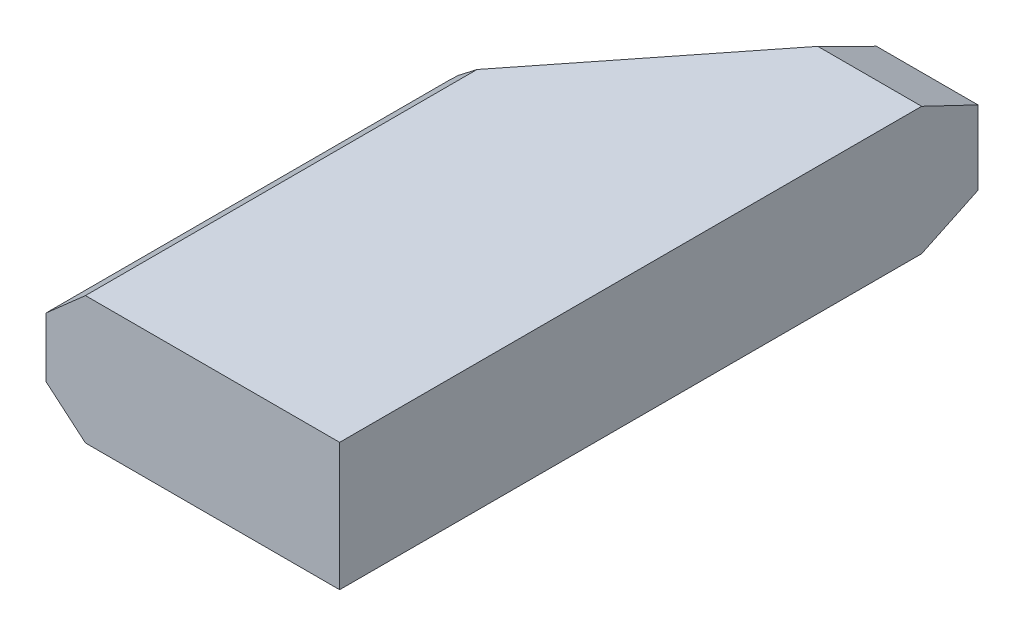
ISO-10303-21;
HEADER;
FILE_DESCRIPTION(('STEP AP214'),'2;1');
FILE_NAME('part.step','',(''),(''),'','','');
FILE_SCHEMA(('AUTOMOTIVE_DESIGN { 1 0 10303 214 1 1 1 1 }'));
ENDSEC;
DATA;
#1=APPLICATION_CONTEXT('core data for automotive mechanical design processes');
#2=APPLICATION_PROTOCOL_DEFINITION('international standard','automotive_design',2000,#1);
#3=PRODUCT_CONTEXT('',#1,'mechanical');
#4=PRODUCT('Part','Part','',(#3));
#5=PRODUCT_RELATED_PRODUCT_CATEGORY('part','',(#4));
#6=PRODUCT_DEFINITION_FORMATION('','',#4);
#7=PRODUCT_DEFINITION_CONTEXT('part definition',#1,'design');
#8=PRODUCT_DEFINITION('design','',#6,#7);
#9=PRODUCT_DEFINITION_SHAPE('','',#8);
#10=(LENGTH_UNIT() NAMED_UNIT(*) SI_UNIT(.MILLI.,.METRE.));
#11=(NAMED_UNIT(*) PLANE_ANGLE_UNIT() SI_UNIT($,.RADIAN.));
#12=(NAMED_UNIT(*) SI_UNIT($,.STERADIAN.) SOLID_ANGLE_UNIT());
#13=UNCERTAINTY_MEASURE_WITH_UNIT(LENGTH_MEASURE(1.E-05),#10,'distance_accuracy_value','');
#14=(GEOMETRIC_REPRESENTATION_CONTEXT(3) GLOBAL_UNCERTAINTY_ASSIGNED_CONTEXT((#13)) GLOBAL_UNIT_ASSIGNED_CONTEXT((#10,
#11,#12)) REPRESENTATION_CONTEXT('',''));
#15=CARTESIAN_POINT('',(0.,0.,0.));
#16=DIRECTION('',(0.,0.,1.));
#17=DIRECTION('',(1.,0.,0.));
#18=AXIS2_PLACEMENT_3D('',#15,#16,#17);
#19=CARTESIAN_POINT('',(0.,0.,-508.));
#20=DIRECTION('',(1.,0.,0.));
#21=DIRECTION('',(0.,0.,-1.));
#22=AXIS2_PLACEMENT_3D('',#19,#20,#21);
#23=PLANE('',#22);
#24=DIRECTION('',(0.,-0.429413418886791,0.903108031012878));
#25=VECTOR('',#24,1.);
#26=CARTESIAN_POINT('',(0.,0.,-463.161638797498));
#27=LINE('',#26,#25);
#28=CARTESIAN_POINT('',(0.,21.3199233314895,-508.));
#29=VERTEX_POINT('',#28);
#30=CARTESIAN_POINT('',(0.,0.,-463.161638797498));
#31=VERTEX_POINT('',#30);
#32=EDGE_CURVE('E169',#29,#31,#27,.T.);
#33=ORIENTED_EDGE('',*,*,#32,.F.);
#34=DIRECTION('',(0.,1.,0.));
#35=VECTOR('',#34,1.);
#36=CARTESIAN_POINT('',(0.,0.,-508.));
#37=LINE('',#36,#35);
#38=CARTESIAN_POINT('',(0.,80.1575164459482,-508.));
#39=VERTEX_POINT('',#38);
#40=EDGE_CURVE('E155',#29,#39,#37,.T.);
#41=ORIENTED_EDGE('',*,*,#40,.T.);
#42=DIRECTION('',(0.,-0.431423565478039,-0.902149492684121));
#43=VECTOR('',#42,1.);
#44=CARTESIAN_POINT('',(0.,101.6,-463.161638797498));
#45=LINE('',#44,#43);
#46=CARTESIAN_POINT('',(0.,101.6,-463.161638797498));
#47=VERTEX_POINT('',#46);
#48=EDGE_CURVE('E175',#47,#39,#45,.T.);
#49=ORIENTED_EDGE('',*,*,#48,.F.);
#50=DIRECTION('',(0.,0.,1.));
#51=VECTOR('',#50,1.);
#52=CARTESIAN_POINT('',(0.,101.6,-508.));
#53=LINE('',#52,#51);
#54=CARTESIAN_POINT('',(0.,101.6,0.));
#55=VERTEX_POINT('',#54);
#56=EDGE_CURVE('E152',#47,#55,#53,.T.);
#57=ORIENTED_EDGE('',*,*,#56,.T.);
#58=DIRECTION('',(0.,1.,0.));
#59=VECTOR('',#58,1.);
#60=CARTESIAN_POINT('',(0.,0.,0.));
#61=LINE('',#60,#59);
#62=CARTESIAN_POINT('',(0.,0.,0.));
#63=VERTEX_POINT('',#62);
#64=EDGE_CURVE('E139',#63,#55,#61,.T.);
#65=ORIENTED_EDGE('',*,*,#64,.F.);
#66=DIRECTION('',(0.,0.,1.));
#67=VECTOR('',#66,1.);
#68=CARTESIAN_POINT('',(0.,0.,-508.));
#69=LINE('',#68,#67);
#70=EDGE_CURVE('E138',#31,#63,#69,.T.);
#71=ORIENTED_EDGE('',*,*,#70,.F.);
#72=EDGE_LOOP('',(#33,#41,#49,#57,#65,#71));
#73=FACE_BOUND('',#72,.T.);
#74=ADVANCED_FACE('F32',(#73),#23,.T.);
#75=CARTESIAN_POINT('',(0.,0.,-508.));
#76=DIRECTION('',(0.,-1.,0.));
#77=DIRECTION('',(0.,0.,-1.));
#78=AXIS2_PLACEMENT_3D('',#75,#76,#77);
#79=PLANE('',#78);
#80=DIRECTION('',(0.619644288579021,0.,-0.784882765533426));
#81=VECTOR('',#80,1.);
#82=CARTESIAN_POINT('',(-365.894548514478,-1.07506525137836E-12,-104.379906721956));
#83=LINE('',#82,#81);
#84=CARTESIAN_POINT('',(-202.283526952623,-4.47404655459673E-13,-311.62053403364));
#85=VERTEX_POINT('',#84);
#86=CARTESIAN_POINT('',(-82.6458126653662,0.,-463.161638797498));
#87=VERTEX_POINT('',#86);
#88=EDGE_CURVE('E154',#85,#87,#83,.T.);
#89=ORIENTED_EDGE('',*,*,#88,.T.);
#90=DIRECTION('',(1.,0.,0.));
#91=VECTOR('',#90,1.);
#92=CARTESIAN_POINT('',(-233.68,0.,-463.161638797498));
#93=LINE('',#92,#91);
#94=EDGE_CURVE('E151',#87,#31,#93,.T.);
#95=ORIENTED_EDGE('',*,*,#94,.T.);
#96=ORIENTED_EDGE('',*,*,#70,.T.);
#97=DIRECTION('',(1.,0.,0.));
#98=VECTOR('',#97,1.);
#99=CARTESIAN_POINT('',(0.,0.,0.));
#100=LINE('',#99,#98);
#101=CARTESIAN_POINT('',(-202.283526952623,0.,0.));
#102=VERTEX_POINT('',#101);
#103=EDGE_CURVE('E129',#102,#63,#100,.T.);
#104=ORIENTED_EDGE('',*,*,#103,.F.);
#105=DIRECTION('',(0.,0.,1.));
#106=VECTOR('',#105,1.);
#107=CARTESIAN_POINT('',(-202.283526952623,0.,-508.));
#108=LINE('',#107,#106);
#109=EDGE_CURVE('E116',#85,#102,#108,.T.);
#110=ORIENTED_EDGE('',*,*,#109,.F.);
#111=EDGE_LOOP('',(#89,#95,#96,#104,#110));
#112=FACE_BOUND('',#111,.T.);
#113=ADVANCED_FACE('F136',(#112),#79,.T.);
#114=CARTESIAN_POINT('',(-233.68,0.,-508.));
#115=DIRECTION('',(-1.,0.,0.));
#116=DIRECTION('',(0.,0.,1.));
#117=AXIS2_PLACEMENT_3D('',#114,#115,#116);
#118=PLANE('',#117);
#119=DIRECTION('',(0.,0.480454682315268,-0.877019554081512));
#120=VECTOR('',#119,1.);
#121=CARTESIAN_POINT('',(-233.68,99.5053860002083,-453.48829795539));
#122=LINE('',#121,#120);
#123=CARTESIAN_POINT('',(-233.68,26.611014762092,-320.427280316363));
#124=VERTEX_POINT('',#123);
#125=CARTESIAN_POINT('',(-233.68,27.2456457358276,-321.585732495265));
#126=VERTEX_POINT('',#125);
#127=EDGE_CURVE('E11',#124,#126,#122,.T.);
#128=ORIENTED_EDGE('',*,*,#127,.F.);
#129=DIRECTION('',(0.,0.,1.));
#130=VECTOR('',#129,1.);
#131=CARTESIAN_POINT('',(-233.68,26.6110147620919,-508.));
#132=LINE('',#131,#130);
#133=CARTESIAN_POINT('',(-233.68,26.6110147620919,0.));
#134=VERTEX_POINT('',#133);
#135=EDGE_CURVE('E150',#124,#134,#132,.T.);
#136=ORIENTED_EDGE('',*,*,#135,.T.);
#137=DIRECTION('',(0.,-1.,0.));
#138=VECTOR('',#137,1.);
#139=CARTESIAN_POINT('',(-233.68,0.,0.));
#140=LINE('',#139,#138);
#141=CARTESIAN_POINT('',(-233.68,73.9080678482201,0.));
#142=VERTEX_POINT('',#141);
#143=EDGE_CURVE('E133',#142,#134,#140,.T.);
#144=ORIENTED_EDGE('',*,*,#143,.F.);
#145=DIRECTION('',(0.,0.,1.));
#146=VECTOR('',#145,1.);
#147=CARTESIAN_POINT('',(-233.68,73.9080678482201,-508.));
#148=LINE('',#147,#146);
#149=CARTESIAN_POINT('',(-233.68,73.9080678482201,-321.585732495265));
#150=VERTEX_POINT('',#149);
#151=EDGE_CURVE('E195',#150,#142,#148,.T.);
#152=ORIENTED_EDGE('',*,*,#151,.F.);
#153=DIRECTION('',(0.,1.,0.));
#154=VECTOR('',#153,1.);
#155=CARTESIAN_POINT('',(-233.68,0.,-321.585732495265));
#156=LINE('',#155,#154);
#157=EDGE_CURVE('E165',#126,#150,#156,.T.);
#158=ORIENTED_EDGE('',*,*,#157,.F.);
#159=EDGE_LOOP('',(#128,#136,#144,#152,#158));
#160=FACE_BOUND('',#159,.T.);
#161=ADVANCED_FACE('F217',(#160),#118,.T.);
#162=CARTESIAN_POINT('',(0.,101.6,-508.));
#163=DIRECTION('',(0.,1.,0.));
#164=DIRECTION('',(0.,0.,1.));
#165=AXIS2_PLACEMENT_3D('',#162,#163,#164);
#166=PLANE('',#165);
#167=DIRECTION('',(0.619644288579021,0.,-0.784882765533426));
#168=VECTOR('',#167,1.);
#169=CARTESIAN_POINT('',(-365.894548514478,101.599999999999,-104.379906721956));
#170=LINE('',#169,#168);
#171=CARTESIAN_POINT('',(-202.283526952624,101.6,-311.620534033638));
#172=VERTEX_POINT('',#171);
#173=CARTESIAN_POINT('',(-82.6458126653659,101.6,-463.161638797498));
#174=VERTEX_POINT('',#173);
#175=EDGE_CURVE('E42',#172,#174,#170,.T.);
#176=ORIENTED_EDGE('',*,*,#175,.F.);
#177=DIRECTION('',(0.,0.,1.));
#178=VECTOR('',#177,1.);
#179=CARTESIAN_POINT('',(-202.283526952623,101.6,-508.));
#180=LINE('',#179,#178);
#181=CARTESIAN_POINT('',(-202.283526952623,101.6,0.));
#182=VERTEX_POINT('',#181);
#183=EDGE_CURVE('E167',#172,#182,#180,.T.);
#184=ORIENTED_EDGE('',*,*,#183,.T.);
#185=DIRECTION('',(-1.,0.,0.));
#186=VECTOR('',#185,1.);
#187=CARTESIAN_POINT('',(0.,101.6,0.));
#188=LINE('',#187,#186);
#189=EDGE_CURVE('E142',#55,#182,#188,.T.);
#190=ORIENTED_EDGE('',*,*,#189,.F.);
#191=ORIENTED_EDGE('',*,*,#56,.F.);
#192=DIRECTION('',(1.,0.,0.));
#193=VECTOR('',#192,1.);
#194=CARTESIAN_POINT('',(-233.68,101.6,-463.161638797498));
#195=LINE('',#194,#193);
#196=EDGE_CURVE('E159',#174,#47,#195,.T.);
#197=ORIENTED_EDGE('',*,*,#196,.F.);
#198=EDGE_LOOP('',(#176,#184,#190,#191,#197));
#199=FACE_BOUND('',#198,.T.);
#200=ADVANCED_FACE('F208',(#199),#166,.T.);
#201=CARTESIAN_POINT('',(0.,0.,-508.));
#202=DIRECTION('',(0.,0.,1.));
#203=DIRECTION('',(1.,0.,0.));
#204=AXIS2_PLACEMENT_3D('',#201,#202,#203);
#205=PLANE('',#204);
#206=DIRECTION('',(1.,0.,0.));
#207=VECTOR('',#206,1.);
#208=CARTESIAN_POINT('',(-233.68,21.3199233314895,-508.));
#209=LINE('',#208,#207);
#210=CARTESIAN_POINT('',(-77.9712752917137,21.3199233314895,-508.));
#211=VERTEX_POINT('',#210);
#212=EDGE_CURVE('E168',#211,#29,#209,.T.);
#213=ORIENTED_EDGE('',*,*,#212,.F.);
#214=DIRECTION('',(-0.821574182423312,0.570101624954241,0.));
#215=VECTOR('',#214,1.);
#216=CARTESIAN_POINT('',(-15.3560590674221,-22.1296364039903,-508.));
#217=LINE('',#216,#215);
#218=CARTESIAN_POINT('',(-87.0707706911871,27.6341883353326,-507.999999988076));
#219=VERTEX_POINT('',#218);
#220=EDGE_CURVE('E69',#211,#219,#217,.T.);
#221=ORIENTED_EDGE('',*,*,#220,.T.);
#222=DIRECTION('',(0.,1.,0.));
#223=VECTOR('',#222,1.);
#224=CARTESIAN_POINT('',(-87.070770681791,0.,-508.));
#225=LINE('',#224,#223);
#226=CARTESIAN_POINT('',(-87.0707706840187,76.175565290538,-507.999999997173));
#227=VERTEX_POINT('',#226);
#228=EDGE_CURVE('E36',#219,#227,#225,.T.);
#229=ORIENTED_EDGE('',*,*,#228,.T.);
#230=DIRECTION('',(0.842873496109832,0.538111763071194,0.));
#231=VECTOR('',#230,1.);
#232=CARTESIAN_POINT('',(-59.7627844012635,93.6096745740283,-508.));
#233=LINE('',#232,#231);
#234=CARTESIAN_POINT('',(-80.833625683239,80.1575164459482,-508.));
#235=VERTEX_POINT('',#234);
#236=EDGE_CURVE('E144',#227,#235,#233,.T.);
#237=ORIENTED_EDGE('',*,*,#236,.T.);
#238=DIRECTION('',(1.,0.,0.));
#239=VECTOR('',#238,1.);
#240=CARTESIAN_POINT('',(-233.68,80.1575164459482,-508.));
#241=LINE('',#240,#239);
#242=EDGE_CURVE('E140',#235,#39,#241,.T.);
#243=ORIENTED_EDGE('',*,*,#242,.T.);
#244=ORIENTED_EDGE('',*,*,#40,.F.);
#245=EDGE_LOOP('',(#213,#221,#229,#237,#243,#244));
#246=FACE_BOUND('',#245,.T.);
#247=ADVANCED_FACE('F34',(#246),#205,.F.);
#248=CARTESIAN_POINT('',(0.,0.,0.));
#249=DIRECTION('',(0.,0.,1.));
#250=DIRECTION('',(1.,0.,0.));
#251=AXIS2_PLACEMENT_3D('',#248,#249,#250);
#252=PLANE('',#251);
#253=DIRECTION('',(-0.76284964895681,0.646575914403306,0.));
#254=VECTOR('',#253,1.);
#255=CARTESIAN_POINT('',(-202.283526952623,0.,0.));
#256=LINE('',#255,#254);
#257=EDGE_CURVE('E120',#102,#134,#256,.T.);
#258=ORIENTED_EDGE('',*,*,#257,.F.);
#259=ORIENTED_EDGE('',*,*,#103,.T.);
#260=ORIENTED_EDGE('',*,*,#64,.T.);
#261=ORIENTED_EDGE('',*,*,#189,.T.);
#262=DIRECTION('',(0.749966279509935,0.661476061243357,0.));
#263=VECTOR('',#262,1.);
#264=CARTESIAN_POINT('',(-202.283526952623,101.6,0.));
#265=LINE('',#264,#263);
#266=EDGE_CURVE('E161',#142,#182,#265,.T.);
#267=ORIENTED_EDGE('',*,*,#266,.F.);
#268=ORIENTED_EDGE('',*,*,#143,.T.);
#269=EDGE_LOOP('',(#258,#259,#260,#261,#267,#268));
#270=FACE_BOUND('',#269,.T.);
#271=ADVANCED_FACE('F127',(#270),#252,.T.);
#272=CARTESIAN_POINT('',(-202.283526952623,101.6,-508.));
#273=DIRECTION('',(0.661476061243357,-0.749966279509935,0.));
#274=DIRECTION('',(0.749966279509936,0.661476061243357,0.));
#275=AXIS2_PLACEMENT_3D('',#272,#273,#274);
#276=PLANE('',#275);
#277=ORIENTED_EDGE('',*,*,#183,.F.);
#278=DIRECTION('',(-0.705083175848917,-0.621888816540211,-0.340752131316916));
#279=VECTOR('',#278,1.);
#280=CARTESIAN_POINT('',(-249.465381518062,59.985239213025,-334.422549531031));
#281=LINE('',#280,#279);
#282=CARTESIAN_POINT('',(-230.712073852629,76.5258016739419,-325.359463394358));
#283=VERTEX_POINT('',#282);
#284=EDGE_CURVE('E187',#172,#283,#281,.T.);
#285=ORIENTED_EDGE('',*,*,#284,.T.);
#286=DIRECTION('',(-0.542752462982447,-0.478711871790235,0.690112097947556));
#287=VECTOR('',#286,1.);
#288=CARTESIAN_POINT('',(-147.412909387678,149.996309242821,-431.274710338239));
#289=LINE('',#288,#287);
#290=EDGE_CURVE('E189',#283,#150,#289,.T.);
#291=ORIENTED_EDGE('',*,*,#290,.T.);
#292=ORIENTED_EDGE('',*,*,#151,.T.);
#293=ORIENTED_EDGE('',*,*,#266,.T.);
#294=EDGE_LOOP('',(#277,#285,#291,#292,#293));
#295=FACE_BOUND('',#294,.T.);
#296=ADVANCED_FACE('F212',(#295),#276,.F.);
#297=CARTESIAN_POINT('',(-202.283526952623,0.,-508.));
#298=DIRECTION('',(0.646575914403306,0.76284964895681,0.));
#299=DIRECTION('',(-0.762849648956811,0.646575914403306,0.));
#300=AXIS2_PLACEMENT_3D('',#297,#298,#299);
#301=PLANE('',#300);
#302=ORIENTED_EDGE('',*,*,#135,.F.);
#303=DIRECTION('',(0.745962890005618,-0.632263039480828,0.209243436315052));
#304=VECTOR('',#303,1.);
#305=CARTESIAN_POINT('',(-232.935973314868,25.980392810653,-320.21857998771));
#306=LINE('',#305,#304);
#307=EDGE_CURVE('E50',#124,#85,#306,.T.);
#308=ORIENTED_EDGE('',*,*,#307,.T.);
#309=ORIENTED_EDGE('',*,*,#109,.T.);
#310=ORIENTED_EDGE('',*,*,#257,.T.);
#311=EDGE_LOOP('',(#302,#308,#309,#310));
#312=FACE_BOUND('',#311,.T.);
#313=ADVANCED_FACE('F119',(#312),#301,.F.);
#314=CARTESIAN_POINT('',(-87.070770681791,0.,-508.));
#315=DIRECTION('',(0.786029677767914,0.,0.618188762165788));
#316=DIRECTION('',(0.618188762165788,0.,-0.786029677767914));
#317=AXIS2_PLACEMENT_3D('',#314,#315,#316);
#318=PLANE('',#317);
#319=ORIENTED_EDGE('',*,*,#228,.F.);
#320=DIRECTION('',(-0.618187932530704,-0.00163831668315015,0.786028622883327));
#321=VECTOR('',#320,1.);
#322=CARTESIAN_POINT('',(-87.0987582451612,27.6341141629299,-507.964413692445));
#323=LINE('',#322,#321);
#324=EDGE_CURVE('E134',#219,#126,#323,.T.);
#325=ORIENTED_EDGE('',*,*,#324,.T.);
#326=ORIENTED_EDGE('',*,*,#157,.T.);
#327=ORIENTED_EDGE('',*,*,#290,.F.);
#328=DIRECTION('',(0.61818805990822,-0.00150730984464742,-0.786028784844387));
#329=VECTOR('',#328,1.);
#330=CARTESIAN_POINT('',(-86.9997902177974,76.1753922209484,-508.090251966155));
#331=LINE('',#330,#329);
#332=EDGE_CURVE('E160',#283,#227,#331,.T.);
#333=ORIENTED_EDGE('',*,*,#332,.T.);
#334=EDGE_LOOP('',(#319,#325,#326,#327,#333));
#335=FACE_BOUND('',#334,.T.);
#336=ADVANCED_FACE('F221',(#335),#318,.F.);
#337=CARTESIAN_POINT('',(-233.68,101.6,-463.161638797498));
#338=DIRECTION('',(0.,-0.90214949268412,0.431423565478039));
#339=DIRECTION('',(0.,-0.431423565478039,-0.902149492684121));
#340=AXIS2_PLACEMENT_3D('',#337,#338,#339);
#341=PLANE('',#340);
#342=ORIENTED_EDGE('',*,*,#242,.F.);
#343=DIRECTION('',(-0.0364370572768785,0.431137078636632,0.901550420265928));
#344=VECTOR('',#343,1.);
#345=CARTESIAN_POINT('',(-82.8463345850861,103.972651392066,-458.200189259394));
#346=LINE('',#345,#344);
#347=EDGE_CURVE('E156',#235,#174,#346,.T.);
#348=ORIENTED_EDGE('',*,*,#347,.T.);
#349=ORIENTED_EDGE('',*,*,#196,.T.);
#350=ORIENTED_EDGE('',*,*,#48,.T.);
#351=EDGE_LOOP('',(#342,#348,#349,#350));
#352=FACE_BOUND('',#351,.T.);
#353=ADVANCED_FACE('F228',(#352),#341,.F.);
#354=CARTESIAN_POINT('',(-233.68,0.,-463.161638797498));
#355=DIRECTION('',(0.,0.903108031012878,0.429413418886791));
#356=DIRECTION('',(0.,-0.429413418886791,0.903108031012878));
#357=AXIS2_PLACEMENT_3D('',#354,#355,#356);
#358=PLANE('',#357);
#359=ORIENTED_EDGE('',*,*,#94,.F.);
#360=DIRECTION('',(0.0937372430843206,0.427522699278668,-0.899131620431866));
#361=VECTOR('',#360,1.);
#362=CARTESIAN_POINT('',(-83.9729003401175,-6.05266472770893,-450.432157406831));
#363=LINE('',#362,#361);
#364=EDGE_CURVE('E64',#87,#211,#363,.T.);
#365=ORIENTED_EDGE('',*,*,#364,.T.);
#366=ORIENTED_EDGE('',*,*,#212,.T.);
#367=ORIENTED_EDGE('',*,*,#32,.T.);
#368=EDGE_LOOP('',(#359,#365,#366,#367));
#369=FACE_BOUND('',#368,.T.);
#370=ADVANCED_FACE('F232',(#369),#358,.F.);
#371=CARTESIAN_POINT('',(-365.894548514478,101.599999999999,-104.379906721956));
#372=DIRECTION('',(0.495272074440297,-0.775771379771588,0.391004269294969));
#373=DIRECTION('',(0.842873496109832,0.538111763071194,0.));
#374=AXIS2_PLACEMENT_3D('',#371,#372,#373);
#375=PLANE('',#374);
#376=ORIENTED_EDGE('',*,*,#175,.T.);
#377=ORIENTED_EDGE('',*,*,#347,.F.);
#378=ORIENTED_EDGE('',*,*,#236,.F.);
#379=ORIENTED_EDGE('',*,*,#332,.F.);
#380=ORIENTED_EDGE('',*,*,#284,.F.);
#381=EDGE_LOOP('',(#376,#377,#378,#379,#380));
#382=FACE_BOUND('',#381,.T.);
#383=ADVANCED_FACE('F226',(#382),#375,.F.);
#384=CARTESIAN_POINT('',(-390.42755668281,27.6341883353439,-123.748071065376));
#385=DIRECTION('',(0.519872322238841,0.749188669901032,0.410425517556982));
#386=DIRECTION('',(-0.821574182423312,0.570101624954241,0.));
#387=AXIS2_PLACEMENT_3D('',#384,#385,#386);
#388=PLANE('',#387);
#389=ORIENTED_EDGE('',*,*,#127,.T.);
#390=ORIENTED_EDGE('',*,*,#324,.F.);
#391=ORIENTED_EDGE('',*,*,#220,.F.);
#392=ORIENTED_EDGE('',*,*,#364,.F.);
#393=ORIENTED_EDGE('',*,*,#88,.F.);
#394=ORIENTED_EDGE('',*,*,#307,.F.);
#395=EDGE_LOOP('',(#389,#390,#391,#392,#393,#394));
#396=FACE_BOUND('',#395,.T.);
#397=ADVANCED_FACE('F218',(#396),#388,.F.);
#398=CLOSED_SHELL('',(#74,#113,#161,#200,#247,#271,#296,#313,#336,#353,#370,#383,#397));
#399=MANIFOLD_SOLID_BREP('B2',#398);
#400=ADVANCED_BREP_SHAPE_REPRESENTATION('',(#18,#399),#14);
#401=SHAPE_DEFINITION_REPRESENTATION(#9,#400);
ENDSEC;
END-ISO-10303-21;
